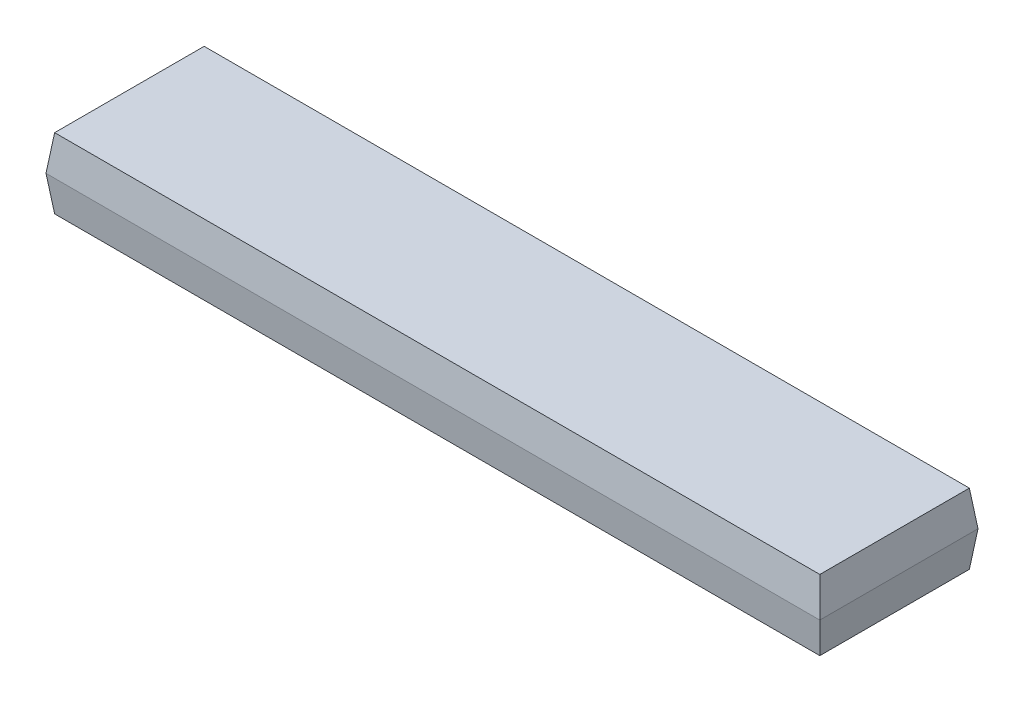
ISO-10303-21;
HEADER;
FILE_DESCRIPTION(('STEP AP214'),'2;1');
FILE_NAME('part.step','',(''),(''),'','','');
FILE_SCHEMA(('AUTOMOTIVE_DESIGN { 1 0 10303 214 1 1 1 1 }'));
ENDSEC;
DATA;
#1=APPLICATION_CONTEXT('core data for automotive mechanical design processes');
#2=APPLICATION_PROTOCOL_DEFINITION('international standard','automotive_design',2000,#1);
#3=PRODUCT_CONTEXT('',#1,'mechanical');
#4=PRODUCT('Part','Part','',(#3));
#5=PRODUCT_RELATED_PRODUCT_CATEGORY('part','',(#4));
#6=PRODUCT_DEFINITION_FORMATION('','',#4);
#7=PRODUCT_DEFINITION_CONTEXT('part definition',#1,'design');
#8=PRODUCT_DEFINITION('design','',#6,#7);
#9=PRODUCT_DEFINITION_SHAPE('','',#8);
#10=(LENGTH_UNIT() NAMED_UNIT(*) SI_UNIT(.MILLI.,.METRE.));
#11=(NAMED_UNIT(*) PLANE_ANGLE_UNIT() SI_UNIT($,.RADIAN.));
#12=(NAMED_UNIT(*) SI_UNIT($,.STERADIAN.) SOLID_ANGLE_UNIT());
#13=UNCERTAINTY_MEASURE_WITH_UNIT(LENGTH_MEASURE(1.E-05),#10,'distance_accuracy_value','');
#14=(GEOMETRIC_REPRESENTATION_CONTEXT(3) GLOBAL_UNCERTAINTY_ASSIGNED_CONTEXT((#13)) GLOBAL_UNIT_ASSIGNED_CONTEXT((#10,
#11,#12)) REPRESENTATION_CONTEXT('',''));
#15=CARTESIAN_POINT('',(0.,0.,0.));
#16=DIRECTION('',(0.,0.,1.));
#17=DIRECTION('',(1.,0.,0.));
#18=AXIS2_PLACEMENT_3D('',#15,#16,#17);
#19=CARTESIAN_POINT('',(0.,0.,0.));
#20=DIRECTION('',(-0.992546151641322,-0.121869343405148,0.));
#21=DIRECTION('',(0.121869343405148,-0.992546151641322,0.));
#22=AXIS2_PLACEMENT_3D('',#19,#20,#21);
#23=PLANE('',#22);
#24=DIRECTION('',(0.,0.,1.));
#25=VECTOR('',#24,1.);
#26=CARTESIAN_POINT('',(0.,0.,0.));
#27=LINE('',#26,#25);
#28=CARTESIAN_POINT('',(0.,0.,-6.8));
#29=VERTEX_POINT('',#28);
#30=CARTESIAN_POINT('',(0.,0.,0.));
#31=VERTEX_POINT('',#30);
#32=EDGE_CURVE('E135',#29,#31,#27,.T.);
#33=ORIENTED_EDGE('',*,*,#32,.T.);
#34=DIRECTION('',(0.120974291151355,-0.985256536015293,-0.120974291151355));
#35=VECTOR('',#34,1.);
#36=CARTESIAN_POINT('',(0.,0.,0.));
#37=LINE('',#36,#35);
#38=CARTESIAN_POINT('',(-0.196455297444648,1.6,0.196455297444648));
#39=VERTEX_POINT('',#38);
#40=EDGE_CURVE('E11',#39,#31,#37,.T.);
#41=ORIENTED_EDGE('',*,*,#40,.F.);
#42=DIRECTION('',(0.,0.,-1.));
#43=VECTOR('',#42,1.);
#44=CARTESIAN_POINT('',(-0.196455297444648,1.6,0.));
#45=LINE('',#44,#43);
#46=CARTESIAN_POINT('',(-0.196455297444648,1.6,-6.99645529744465));
#47=VERTEX_POINT('',#46);
#48=EDGE_CURVE('E89',#47,#39,#45,.F.);
#49=ORIENTED_EDGE('',*,*,#48,.F.);
#50=DIRECTION('',(0.120974291151355,-0.985256536015293,0.120974291151355));
#51=VECTOR('',#50,1.);
#52=CARTESIAN_POINT('',(0.0995164980130948,-0.810496835117488,-6.7004835019869));
#53=LINE('',#52,#51);
#54=EDGE_CURVE('E92',#47,#29,#53,.T.);
#55=ORIENTED_EDGE('',*,*,#54,.T.);
#56=EDGE_LOOP('',(#33,#41,#49,#55));
#57=FACE_BOUND('',#56,.T.);
#58=ADVANCED_FACE('F34',(#57),#23,.T.);
#59=CARTESIAN_POINT('',(0.,0.,0.));
#60=DIRECTION('',(0.,-0.121869343405148,0.992546151641322));
#61=DIRECTION('',(0.,-0.992546151641322,-0.121869343405148));
#62=AXIS2_PLACEMENT_3D('',#59,#60,#61);
#63=PLANE('',#62);
#64=DIRECTION('',(1.,0.,0.));
#65=VECTOR('',#64,1.);
#66=CARTESIAN_POINT('',(0.,0.,0.));
#67=LINE('',#66,#65);
#68=CARTESIAN_POINT('',(34.8,0.,0.));
#69=VERTEX_POINT('',#68);
#70=EDGE_CURVE('E137',#31,#69,#67,.T.);
#71=ORIENTED_EDGE('',*,*,#70,.T.);
#72=DIRECTION('',(-0.120974291151355,-0.985256536015293,-0.120974291151355));
#73=VECTOR('',#72,1.);
#74=CARTESIAN_POINT('',(34.8,0.,0.));
#75=LINE('',#74,#73);
#76=CARTESIAN_POINT('',(34.9964552974446,1.6,0.196455297444648));
#77=VERTEX_POINT('',#76);
#78=EDGE_CURVE('E43',#77,#69,#75,.T.);
#79=ORIENTED_EDGE('',*,*,#78,.F.);
#80=DIRECTION('',(-1.,0.,0.));
#81=VECTOR('',#80,1.);
#82=CARTESIAN_POINT('',(0.,1.6,0.196455297444648));
#83=LINE('',#82,#81);
#84=EDGE_CURVE('E98',#39,#77,#83,.F.);
#85=ORIENTED_EDGE('',*,*,#84,.F.);
#86=ORIENTED_EDGE('',*,*,#40,.T.);
#87=EDGE_LOOP('',(#71,#79,#85,#86));
#88=FACE_BOUND('',#87,.T.);
#89=ADVANCED_FACE('F36',(#88),#63,.T.);
#90=CARTESIAN_POINT('',(34.8,0.,0.));
#91=DIRECTION('',(0.992546151641322,-0.121869343405148,0.));
#92=DIRECTION('',(0.121869343405148,0.992546151641322,0.));
#93=AXIS2_PLACEMENT_3D('',#90,#91,#92);
#94=PLANE('',#93);
#95=DIRECTION('',(0.,0.,-1.));
#96=VECTOR('',#95,1.);
#97=CARTESIAN_POINT('',(34.8,0.,0.));
#98=LINE('',#97,#96);
#99=CARTESIAN_POINT('',(34.8,0.,-6.8));
#100=VERTEX_POINT('',#99);
#101=EDGE_CURVE('E139',#69,#100,#98,.T.);
#102=ORIENTED_EDGE('',*,*,#101,.T.);
#103=DIRECTION('',(-0.120974291151355,-0.985256536015293,0.120974291151355));
#104=VECTOR('',#103,1.);
#105=CARTESIAN_POINT('',(34.2907096866389,-4.14783674442479,-6.29070968663887));
#106=LINE('',#105,#104);
#107=CARTESIAN_POINT('',(34.9964552974446,1.6,-6.99645529744465));
#108=VERTEX_POINT('',#107);
#109=EDGE_CURVE('E51',#108,#100,#106,.T.);
#110=ORIENTED_EDGE('',*,*,#109,.F.);
#111=DIRECTION('',(0.,0.,1.));
#112=VECTOR('',#111,1.);
#113=CARTESIAN_POINT('',(34.9964552974446,1.6,0.));
#114=LINE('',#113,#112);
#115=EDGE_CURVE('E116',#77,#108,#114,.F.);
#116=ORIENTED_EDGE('',*,*,#115,.F.);
#117=ORIENTED_EDGE('',*,*,#78,.T.);
#118=EDGE_LOOP('',(#102,#110,#116,#117));
#119=FACE_BOUND('',#118,.T.);
#120=ADVANCED_FACE('F149',(#119),#94,.T.);
#121=CARTESIAN_POINT('',(0.,0.,-6.8));
#122=DIRECTION('',(0.,-0.121869343405148,-0.992546151641322));
#123=DIRECTION('',(0.,0.992546151641322,-0.121869343405148));
#124=AXIS2_PLACEMENT_3D('',#121,#122,#123);
#125=PLANE('',#124);
#126=DIRECTION('',(-1.,0.,0.));
#127=VECTOR('',#126,1.);
#128=CARTESIAN_POINT('',(0.,0.,-6.8));
#129=LINE('',#128,#127);
#130=EDGE_CURVE('E99',#100,#29,#129,.T.);
#131=ORIENTED_EDGE('',*,*,#130,.T.);
#132=ORIENTED_EDGE('',*,*,#54,.F.);
#133=DIRECTION('',(1.,0.,0.));
#134=VECTOR('',#133,1.);
#135=CARTESIAN_POINT('',(0.,1.6,-6.99645529744465));
#136=LINE('',#135,#134);
#137=EDGE_CURVE('E38',#108,#47,#136,.F.);
#138=ORIENTED_EDGE('',*,*,#137,.F.);
#139=ORIENTED_EDGE('',*,*,#109,.T.);
#140=EDGE_LOOP('',(#131,#132,#138,#139));
#141=FACE_BOUND('',#140,.T.);
#142=ADVANCED_FACE('F103',(#141),#125,.T.);
#143=CARTESIAN_POINT('',(0.,0.,0.));
#144=DIRECTION('',(0.,-1.,0.));
#145=DIRECTION('',(0.,0.,-1.));
#146=AXIS2_PLACEMENT_3D('',#143,#144,#145);
#147=PLANE('',#146);
#148=ORIENTED_EDGE('',*,*,#32,.F.);
#149=ORIENTED_EDGE('',*,*,#130,.F.);
#150=ORIENTED_EDGE('',*,*,#101,.F.);
#151=ORIENTED_EDGE('',*,*,#70,.F.);
#152=EDGE_LOOP('',(#148,#149,#150,#151));
#153=FACE_BOUND('',#152,.T.);
#154=ADVANCED_FACE('F154',(#153),#147,.T.);
#155=CARTESIAN_POINT('',(-0.196455297444648,1.6,-6.99645529744465));
#156=DIRECTION('',(-0.992546151641322,0.121869343405148,0.));
#157=DIRECTION('',(-0.121869343405148,-0.992546151641322,0.));
#158=AXIS2_PLACEMENT_3D('',#155,#156,#157);
#159=PLANE('',#158);
#160=ORIENTED_EDGE('',*,*,#48,.T.);
#161=DIRECTION('',(-0.120974291151355,-0.985256536015293,0.120974291151355));
#162=VECTOR('',#161,1.);
#163=CARTESIAN_POINT('',(-0.196455297444648,1.6,0.196455297444648));
#164=LINE('',#163,#162);
#165=CARTESIAN_POINT('',(0.,3.2,0.));
#166=VERTEX_POINT('',#165);
#167=EDGE_CURVE('E127',#166,#39,#164,.T.);
#168=ORIENTED_EDGE('',*,*,#167,.F.);
#169=DIRECTION('',(0.,0.,-1.));
#170=VECTOR('',#169,1.);
#171=CARTESIAN_POINT('',(0.,3.2,-6.99645529744465));
#172=LINE('',#171,#170);
#173=CARTESIAN_POINT('',(0.,3.2,-6.8));
#174=VERTEX_POINT('',#173);
#175=EDGE_CURVE('E119',#174,#166,#172,.F.);
#176=ORIENTED_EDGE('',*,*,#175,.F.);
#177=DIRECTION('',(-0.120974291151355,-0.985256536015293,-0.120974291151355));
#178=VECTOR('',#177,1.);
#179=CARTESIAN_POINT('',(-0.196455297444648,1.6,-6.99645529744465));
#180=LINE('',#179,#178);
#181=EDGE_CURVE('E112',#174,#47,#180,.T.);
#182=ORIENTED_EDGE('',*,*,#181,.T.);
#183=EDGE_LOOP('',(#160,#168,#176,#182));
#184=FACE_BOUND('',#183,.T.);
#185=ADVANCED_FACE('F117',(#184),#159,.T.);
#186=CARTESIAN_POINT('',(-0.196455297444648,1.6,0.196455297444648));
#187=DIRECTION('',(0.,0.121869343405148,0.992546151641322));
#188=DIRECTION('',(0.,-0.992546151641322,0.121869343405148));
#189=AXIS2_PLACEMENT_3D('',#186,#187,#188);
#190=PLANE('',#189);
#191=ORIENTED_EDGE('',*,*,#84,.T.);
#192=DIRECTION('',(0.120974291151355,-0.985256536015293,0.120974291151355));
#193=VECTOR('',#192,1.);
#194=CARTESIAN_POINT('',(34.8911886396616,2.45732812830012,0.0911886396616083));
#195=LINE('',#194,#193);
#196=CARTESIAN_POINT('',(34.8,3.2,0.));
#197=VERTEX_POINT('',#196);
#198=EDGE_CURVE('E122',#197,#77,#195,.T.);
#199=ORIENTED_EDGE('',*,*,#198,.F.);
#200=DIRECTION('',(-1.,0.,0.));
#201=VECTOR('',#200,1.);
#202=CARTESIAN_POINT('',(-0.196455297444648,3.2,0.));
#203=LINE('',#202,#201);
#204=EDGE_CURVE('E132',#166,#197,#203,.F.);
#205=ORIENTED_EDGE('',*,*,#204,.F.);
#206=ORIENTED_EDGE('',*,*,#167,.T.);
#207=EDGE_LOOP('',(#191,#199,#205,#206));
#208=FACE_BOUND('',#207,.T.);
#209=ADVANCED_FACE('F152',(#208),#190,.T.);
#210=CARTESIAN_POINT('',(34.9964552974446,1.6,-6.99645529744465));
#211=DIRECTION('',(0.992546151641322,0.121869343405148,0.));
#212=DIRECTION('',(-0.121869343405148,0.992546151641322,0.));
#213=AXIS2_PLACEMENT_3D('',#210,#211,#212);
#214=PLANE('',#213);
#215=ORIENTED_EDGE('',*,*,#115,.T.);
#216=DIRECTION('',(0.120974291151355,-0.985256536015293,-0.120974291151355));
#217=VECTOR('',#216,1.);
#218=CARTESIAN_POINT('',(34.4814148243136,5.79466803760742,-6.48141482431357));
#219=LINE('',#218,#217);
#220=CARTESIAN_POINT('',(34.8,3.2,-6.8));
#221=VERTEX_POINT('',#220);
#222=EDGE_CURVE('E115',#221,#108,#219,.T.);
#223=ORIENTED_EDGE('',*,*,#222,.F.);
#224=DIRECTION('',(0.,0.,1.));
#225=VECTOR('',#224,1.);
#226=CARTESIAN_POINT('',(34.8,3.2,-6.99645529744465));
#227=LINE('',#226,#225);
#228=EDGE_CURVE('E124',#197,#221,#227,.F.);
#229=ORIENTED_EDGE('',*,*,#228,.F.);
#230=ORIENTED_EDGE('',*,*,#198,.T.);
#231=EDGE_LOOP('',(#215,#223,#229,#230));
#232=FACE_BOUND('',#231,.T.);
#233=ADVANCED_FACE('F146',(#232),#214,.T.);
#234=CARTESIAN_POINT('',(-0.196455297444648,1.6,-6.99645529744465));
#235=DIRECTION('',(0.,0.121869343405148,-0.992546151641322));
#236=DIRECTION('',(0.,0.992546151641322,0.121869343405148));
#237=AXIS2_PLACEMENT_3D('',#234,#235,#236);
#238=PLANE('',#237);
#239=ORIENTED_EDGE('',*,*,#137,.T.);
#240=ORIENTED_EDGE('',*,*,#181,.F.);
#241=DIRECTION('',(1.,0.,0.));
#242=VECTOR('',#241,1.);
#243=CARTESIAN_POINT('',(-0.196455297444648,3.2,-6.8));
#244=LINE('',#243,#242);
#245=EDGE_CURVE('E120',#221,#174,#244,.F.);
#246=ORIENTED_EDGE('',*,*,#245,.F.);
#247=ORIENTED_EDGE('',*,*,#222,.T.);
#248=EDGE_LOOP('',(#239,#240,#246,#247));
#249=FACE_BOUND('',#248,.T.);
#250=ADVANCED_FACE('F110',(#249),#238,.T.);
#251=CARTESIAN_POINT('',(0.,3.2,0.));
#252=DIRECTION('',(0.,1.,0.));
#253=DIRECTION('',(0.,0.,1.));
#254=AXIS2_PLACEMENT_3D('',#251,#252,#253);
#255=PLANE('',#254);
#256=ORIENTED_EDGE('',*,*,#175,.T.);
#257=ORIENTED_EDGE('',*,*,#204,.T.);
#258=ORIENTED_EDGE('',*,*,#228,.T.);
#259=ORIENTED_EDGE('',*,*,#245,.T.);
#260=EDGE_LOOP('',(#256,#257,#258,#259));
#261=FACE_BOUND('',#260,.T.);
#262=ADVANCED_FACE('F190',(#261),#255,.T.);
#263=CLOSED_SHELL('',(#58,#89,#120,#142,#154,#185,#209,#233,#250,#262));
#264=MANIFOLD_SOLID_BREP('B2',#263);
#265=ADVANCED_BREP_SHAPE_REPRESENTATION('',(#18,#264),#14);
#266=SHAPE_DEFINITION_REPRESENTATION(#9,#265);
ENDSEC;
END-ISO-10303-21;
